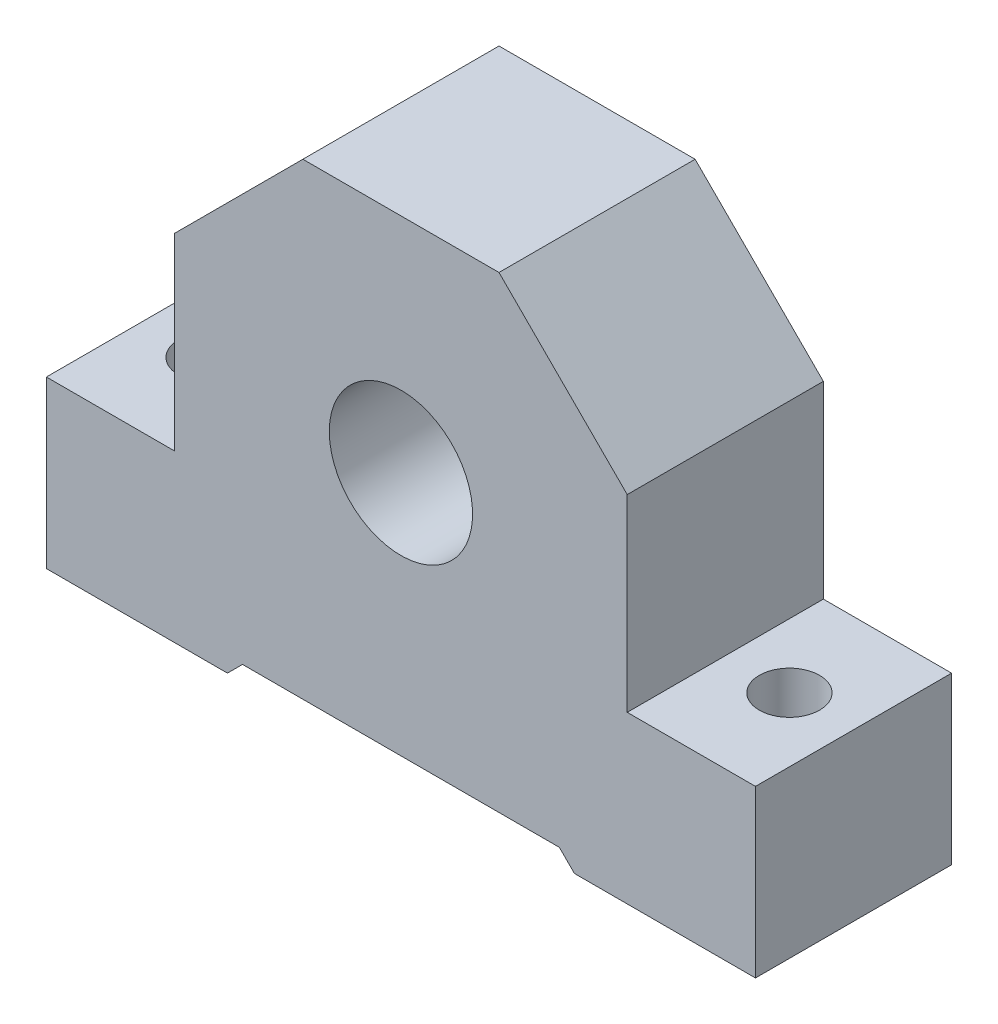
ISO-10303-21;
HEADER;
FILE_DESCRIPTION(('STEP AP214'),'2;1');
FILE_NAME('part.step','',(''),(''),'','','');
FILE_SCHEMA(('AUTOMOTIVE_DESIGN { 1 0 10303 214 1 1 1 1 }'));
ENDSEC;
DATA;
#1=APPLICATION_CONTEXT('core data for automotive mechanical design processes');
#2=APPLICATION_PROTOCOL_DEFINITION('international standard','automotive_design',2000,#1);
#3=PRODUCT_CONTEXT('',#1,'mechanical');
#4=PRODUCT('Part','Part','',(#3));
#5=PRODUCT_RELATED_PRODUCT_CATEGORY('part','',(#4));
#6=PRODUCT_DEFINITION_FORMATION('','',#4);
#7=PRODUCT_DEFINITION_CONTEXT('part definition',#1,'design');
#8=PRODUCT_DEFINITION('design','',#6,#7);
#9=PRODUCT_DEFINITION_SHAPE('','',#8);
#10=(LENGTH_UNIT() NAMED_UNIT(*) SI_UNIT(.MILLI.,.METRE.));
#11=(NAMED_UNIT(*) PLANE_ANGLE_UNIT() SI_UNIT($,.RADIAN.));
#12=(NAMED_UNIT(*) SI_UNIT($,.STERADIAN.) SOLID_ANGLE_UNIT());
#13=UNCERTAINTY_MEASURE_WITH_UNIT(LENGTH_MEASURE(1.E-05),#10,'distance_accuracy_value','');
#14=(GEOMETRIC_REPRESENTATION_CONTEXT(3) GLOBAL_UNCERTAINTY_ASSIGNED_CONTEXT((#13)) GLOBAL_UNIT_ASSIGNED_CONTEXT((#10,
#11,#12)) REPRESENTATION_CONTEXT('',''));
#15=CARTESIAN_POINT('',(0.,0.,0.));
#16=DIRECTION('',(0.,0.,1.));
#17=DIRECTION('',(1.,0.,0.));
#18=AXIS2_PLACEMENT_3D('',#15,#16,#17);
#19=CARTESIAN_POINT('',(-47.,-11.,26.));
#20=DIRECTION('',(1.,0.,0.));
#21=DIRECTION('',(0.,1.,0.));
#22=AXIS2_PLACEMENT_3D('',#19,#20,#21);
#23=PLANE('',#22);
#24=DIRECTION('',(0.,-1.,0.));
#25=VECTOR('',#24,1.);
#26=CARTESIAN_POINT('',(-47.,-11.,0.));
#27=LINE('',#26,#25);
#28=CARTESIAN_POINT('',(-47.,11.,0.));
#29=VERTEX_POINT('',#28);
#30=CARTESIAN_POINT('',(-47.,-11.,0.));
#31=VERTEX_POINT('',#30);
#32=EDGE_CURVE('E165',#29,#31,#27,.T.);
#33=ORIENTED_EDGE('',*,*,#32,.T.);
#34=DIRECTION('',(0.,0.,-1.));
#35=VECTOR('',#34,1.);
#36=CARTESIAN_POINT('',(-47.,-11.,26.));
#37=LINE('',#36,#35);
#38=CARTESIAN_POINT('',(-47.,-11.,26.));
#39=VERTEX_POINT('',#38);
#40=EDGE_CURVE('E11',#39,#31,#37,.T.);
#41=ORIENTED_EDGE('',*,*,#40,.F.);
#42=DIRECTION('',(0.,-1.,0.));
#43=VECTOR('',#42,1.);
#44=CARTESIAN_POINT('',(-47.,-11.,26.));
#45=LINE('',#44,#43);
#46=CARTESIAN_POINT('',(-47.,11.,26.));
#47=VERTEX_POINT('',#46);
#48=EDGE_CURVE('E192',#47,#39,#45,.T.);
#49=ORIENTED_EDGE('',*,*,#48,.F.);
#50=DIRECTION('',(0.,0.,-1.));
#51=VECTOR('',#50,1.);
#52=CARTESIAN_POINT('',(-47.,11.,26.));
#53=LINE('',#52,#51);
#54=EDGE_CURVE('E161',#47,#29,#53,.T.);
#55=ORIENTED_EDGE('',*,*,#54,.T.);
#56=EDGE_LOOP('',(#33,#41,#49,#55));
#57=FACE_BOUND('',#56,.T.);
#58=ADVANCED_FACE('F33',(#57),#23,.F.);
#59=CARTESIAN_POINT('',(-47.,-11.,26.));
#60=DIRECTION('',(0.,1.,0.));
#61=DIRECTION('',(0.,0.,1.));
#62=AXIS2_PLACEMENT_3D('',#59,#60,#61);
#63=PLANE('',#62);
#64=CARTESIAN_POINT('',(-38.5,-11.,13.));
#65=DIRECTION('',(0.,1.,0.));
#66=DIRECTION('',(0.,0.,1.));
#67=AXIS2_PLACEMENT_3D('',#64,#65,#66);
#68=CIRCLE('',#67,4.00000000000001);
#69=CARTESIAN_POINT('',(-38.5,-11.,17.));
#70=VERTEX_POINT('',#69);
#71=EDGE_CURVE('E407',#70,#70,#68,.T.);
#72=ORIENTED_EDGE('',*,*,#71,.T.);
#73=EDGE_LOOP('',(#72));
#74=FACE_BOUND('',#73,.T.);
#75=DIRECTION('',(1.,0.,0.));
#76=VECTOR('',#75,1.);
#77=CARTESIAN_POINT('',(-47.,-11.,0.));
#78=LINE('',#77,#76);
#79=CARTESIAN_POINT('',(-23.,-11.,0.));
#80=VERTEX_POINT('',#79);
#81=EDGE_CURVE('E168',#31,#80,#78,.T.);
#82=ORIENTED_EDGE('',*,*,#81,.T.);
#83=DIRECTION('',(0.,0.,-1.));
#84=VECTOR('',#83,1.);
#85=CARTESIAN_POINT('',(-23.,-11.,26.));
#86=LINE('',#85,#84);
#87=CARTESIAN_POINT('',(-23.,-11.,26.));
#88=VERTEX_POINT('',#87);
#89=EDGE_CURVE('E41',#88,#80,#86,.T.);
#90=ORIENTED_EDGE('',*,*,#89,.F.);
#91=DIRECTION('',(1.,0.,0.));
#92=VECTOR('',#91,1.);
#93=CARTESIAN_POINT('',(-47.,-11.,26.));
#94=LINE('',#93,#92);
#95=EDGE_CURVE('E110',#39,#88,#94,.T.);
#96=ORIENTED_EDGE('',*,*,#95,.F.);
#97=ORIENTED_EDGE('',*,*,#40,.T.);
#98=EDGE_LOOP('',(#82,#90,#96,#97));
#99=FACE_BOUND('',#98,.T.);
#100=ADVANCED_FACE('F283',(#74,#99),#63,.F.);
#101=CARTESIAN_POINT('',(-23.,-11.,26.));
#102=DIRECTION('',(-0.70710678118655,0.707106781186545,0.));
#103=DIRECTION('',(-0.707106781186545,-0.70710678118655,0.));
#104=AXIS2_PLACEMENT_3D('',#101,#102,#103);
#105=PLANE('',#104);
#106=DIRECTION('',(0.707106781186545,0.70710678118655,0.));
#107=VECTOR('',#106,1.);
#108=CARTESIAN_POINT('',(-23.,-11.,0.));
#109=LINE('',#108,#107);
#110=CARTESIAN_POINT('',(-21.,-9.00000000000001,0.));
#111=VERTEX_POINT('',#110);
#112=EDGE_CURVE('E171',#80,#111,#109,.T.);
#113=ORIENTED_EDGE('',*,*,#112,.T.);
#114=DIRECTION('',(0.,0.,-1.));
#115=VECTOR('',#114,1.);
#116=CARTESIAN_POINT('',(-21.,-9.00000000000001,26.));
#117=LINE('',#116,#115);
#118=CARTESIAN_POINT('',(-21.,-9.00000000000001,26.));
#119=VERTEX_POINT('',#118);
#120=EDGE_CURVE('E217',#119,#111,#117,.T.);
#121=ORIENTED_EDGE('',*,*,#120,.F.);
#122=DIRECTION('',(0.707106781186545,0.70710678118655,0.));
#123=VECTOR('',#122,1.);
#124=CARTESIAN_POINT('',(-23.,-11.,26.));
#125=LINE('',#124,#123);
#126=EDGE_CURVE('E225',#88,#119,#125,.T.);
#127=ORIENTED_EDGE('',*,*,#126,.F.);
#128=ORIENTED_EDGE('',*,*,#89,.T.);
#129=EDGE_LOOP('',(#113,#121,#127,#128));
#130=FACE_BOUND('',#129,.T.);
#131=ADVANCED_FACE('F223',(#130),#105,.F.);
#132=CARTESIAN_POINT('',(-21.,-9.00000000000001,26.));
#133=DIRECTION('',(0.,1.,0.));
#134=DIRECTION('',(0.,0.,1.));
#135=AXIS2_PLACEMENT_3D('',#132,#133,#134);
#136=PLANE('',#135);
#137=DIRECTION('',(1.,0.,0.));
#138=VECTOR('',#137,1.);
#139=CARTESIAN_POINT('',(-21.,-9.00000000000001,0.));
#140=LINE('',#139,#138);
#141=CARTESIAN_POINT('',(21.,-9.00000000000001,0.));
#142=VERTEX_POINT('',#141);
#143=EDGE_CURVE('E173',#111,#142,#140,.T.);
#144=ORIENTED_EDGE('',*,*,#143,.T.);
#145=DIRECTION('',(0.,0.,-1.));
#146=VECTOR('',#145,1.);
#147=CARTESIAN_POINT('',(21.,-9.00000000000001,26.));
#148=LINE('',#147,#146);
#149=CARTESIAN_POINT('',(21.,-9.00000000000001,26.));
#150=VERTEX_POINT('',#149);
#151=EDGE_CURVE('E214',#150,#142,#148,.T.);
#152=ORIENTED_EDGE('',*,*,#151,.F.);
#153=DIRECTION('',(1.,0.,0.));
#154=VECTOR('',#153,1.);
#155=CARTESIAN_POINT('',(-21.,-9.00000000000001,26.));
#156=LINE('',#155,#154);
#157=EDGE_CURVE('E243',#119,#150,#156,.T.);
#158=ORIENTED_EDGE('',*,*,#157,.F.);
#159=ORIENTED_EDGE('',*,*,#120,.T.);
#160=EDGE_LOOP('',(#144,#152,#158,#159));
#161=FACE_BOUND('',#160,.T.);
#162=ADVANCED_FACE('F234',(#161),#136,.F.);
#163=CARTESIAN_POINT('',(21.,-9.00000000000001,26.));
#164=DIRECTION('',(0.707106781186545,0.70710678118655,0.));
#165=DIRECTION('',(-0.70710678118655,0.707106781186545,0.));
#166=AXIS2_PLACEMENT_3D('',#163,#164,#165);
#167=PLANE('',#166);
#168=DIRECTION('',(0.70710678118655,-0.707106781186545,0.));
#169=VECTOR('',#168,1.);
#170=CARTESIAN_POINT('',(21.,-9.00000000000001,0.));
#171=LINE('',#170,#169);
#172=CARTESIAN_POINT('',(23.,-11.,0.));
#173=VERTEX_POINT('',#172);
#174=EDGE_CURVE('E175',#142,#173,#171,.T.);
#175=ORIENTED_EDGE('',*,*,#174,.T.);
#176=DIRECTION('',(0.,0.,-1.));
#177=VECTOR('',#176,1.);
#178=CARTESIAN_POINT('',(23.,-11.,26.));
#179=LINE('',#178,#177);
#180=CARTESIAN_POINT('',(23.,-11.,26.));
#181=VERTEX_POINT('',#180);
#182=EDGE_CURVE('E211',#181,#173,#179,.T.);
#183=ORIENTED_EDGE('',*,*,#182,.F.);
#184=DIRECTION('',(0.70710678118655,-0.707106781186545,0.));
#185=VECTOR('',#184,1.);
#186=CARTESIAN_POINT('',(21.,-9.00000000000001,26.));
#187=LINE('',#186,#185);
#188=EDGE_CURVE('E240',#150,#181,#187,.T.);
#189=ORIENTED_EDGE('',*,*,#188,.F.);
#190=ORIENTED_EDGE('',*,*,#151,.T.);
#191=EDGE_LOOP('',(#175,#183,#189,#190));
#192=FACE_BOUND('',#191,.T.);
#193=ADVANCED_FACE('F238',(#192),#167,.F.);
#194=CARTESIAN_POINT('',(23.,-11.,26.));
#195=DIRECTION('',(0.,1.,0.));
#196=DIRECTION('',(-1.,0.,0.));
#197=AXIS2_PLACEMENT_3D('',#194,#195,#196);
#198=PLANE('',#197);
#199=CARTESIAN_POINT('',(38.5,-11.,13.));
#200=DIRECTION('',(0.,1.,0.));
#201=DIRECTION('',(0.,0.,1.));
#202=AXIS2_PLACEMENT_3D('',#199,#200,#201);
#203=CIRCLE('',#202,4.00000000000001);
#204=CARTESIAN_POINT('',(38.5,-11.,17.));
#205=VERTEX_POINT('',#204);
#206=EDGE_CURVE('E403',#205,#205,#203,.T.);
#207=ORIENTED_EDGE('',*,*,#206,.T.);
#208=EDGE_LOOP('',(#207));
#209=FACE_BOUND('',#208,.T.);
#210=DIRECTION('',(1.,0.,0.));
#211=VECTOR('',#210,1.);
#212=CARTESIAN_POINT('',(23.,-11.,0.));
#213=LINE('',#212,#211);
#214=CARTESIAN_POINT('',(47.,-11.,0.));
#215=VERTEX_POINT('',#214);
#216=EDGE_CURVE('E177',#173,#215,#213,.T.);
#217=ORIENTED_EDGE('',*,*,#216,.T.);
#218=DIRECTION('',(0.,0.,-1.));
#219=VECTOR('',#218,1.);
#220=CARTESIAN_POINT('',(47.,-11.,26.));
#221=LINE('',#220,#219);
#222=CARTESIAN_POINT('',(47.,-11.,26.));
#223=VERTEX_POINT('',#222);
#224=EDGE_CURVE('E208',#223,#215,#221,.T.);
#225=ORIENTED_EDGE('',*,*,#224,.F.);
#226=DIRECTION('',(1.,0.,0.));
#227=VECTOR('',#226,1.);
#228=CARTESIAN_POINT('',(23.,-11.,26.));
#229=LINE('',#228,#227);
#230=EDGE_CURVE('E242',#181,#223,#229,.T.);
#231=ORIENTED_EDGE('',*,*,#230,.F.);
#232=ORIENTED_EDGE('',*,*,#182,.T.);
#233=EDGE_LOOP('',(#217,#225,#231,#232));
#234=FACE_BOUND('',#233,.T.);
#235=ADVANCED_FACE('F298',(#209,#234),#198,.F.);
#236=CARTESIAN_POINT('',(47.,-11.,26.));
#237=DIRECTION('',(-1.,0.,0.));
#238=DIRECTION('',(0.,-1.,0.));
#239=AXIS2_PLACEMENT_3D('',#236,#237,#238);
#240=PLANE('',#239);
#241=DIRECTION('',(0.,1.,0.));
#242=VECTOR('',#241,1.);
#243=CARTESIAN_POINT('',(47.,-11.,0.));
#244=LINE('',#243,#242);
#245=CARTESIAN_POINT('',(47.,11.,0.));
#246=VERTEX_POINT('',#245);
#247=EDGE_CURVE('E179',#215,#246,#244,.T.);
#248=ORIENTED_EDGE('',*,*,#247,.T.);
#249=DIRECTION('',(0.,0.,-1.));
#250=VECTOR('',#249,1.);
#251=CARTESIAN_POINT('',(47.,11.,26.));
#252=LINE('',#251,#250);
#253=CARTESIAN_POINT('',(47.,11.,26.));
#254=VERTEX_POINT('',#253);
#255=EDGE_CURVE('E205',#254,#246,#252,.T.);
#256=ORIENTED_EDGE('',*,*,#255,.F.);
#257=DIRECTION('',(0.,1.,0.));
#258=VECTOR('',#257,1.);
#259=CARTESIAN_POINT('',(47.,-11.,26.));
#260=LINE('',#259,#258);
#261=EDGE_CURVE('E245',#223,#254,#260,.T.);
#262=ORIENTED_EDGE('',*,*,#261,.F.);
#263=ORIENTED_EDGE('',*,*,#224,.T.);
#264=EDGE_LOOP('',(#248,#256,#262,#263));
#265=FACE_BOUND('',#264,.T.);
#266=ADVANCED_FACE('F301',(#265),#240,.F.);
#267=CARTESIAN_POINT('',(30.,11.,26.));
#268=DIRECTION('',(0.,-1.,0.));
#269=DIRECTION('',(0.,0.,-1.));
#270=AXIS2_PLACEMENT_3D('',#267,#268,#269);
#271=PLANE('',#270);
#272=CARTESIAN_POINT('',(38.5,11.,13.));
#273=DIRECTION('',(0.,1.,0.));
#274=DIRECTION('',(0.,0.,1.));
#275=AXIS2_PLACEMENT_3D('',#272,#273,#274);
#276=CIRCLE('',#275,4.00000000000001);
#277=CARTESIAN_POINT('',(38.5,11.,17.));
#278=VERTEX_POINT('',#277);
#279=EDGE_CURVE('E406',#278,#278,#276,.T.);
#280=ORIENTED_EDGE('',*,*,#279,.F.);
#281=EDGE_LOOP('',(#280));
#282=FACE_BOUND('',#281,.T.);
#283=DIRECTION('',(-1.,0.,0.));
#284=VECTOR('',#283,1.);
#285=CARTESIAN_POINT('',(30.,11.,0.));
#286=LINE('',#285,#284);
#287=CARTESIAN_POINT('',(30.,11.,0.));
#288=VERTEX_POINT('',#287);
#289=EDGE_CURVE('E181',#246,#288,#286,.T.);
#290=ORIENTED_EDGE('',*,*,#289,.T.);
#291=DIRECTION('',(0.,0.,-1.));
#292=VECTOR('',#291,1.);
#293=CARTESIAN_POINT('',(30.,11.,26.));
#294=LINE('',#293,#292);
#295=CARTESIAN_POINT('',(30.,11.,26.));
#296=VERTEX_POINT('',#295);
#297=EDGE_CURVE('E202',#296,#288,#294,.T.);
#298=ORIENTED_EDGE('',*,*,#297,.F.);
#299=DIRECTION('',(-1.,0.,0.));
#300=VECTOR('',#299,1.);
#301=CARTESIAN_POINT('',(30.,11.,26.));
#302=LINE('',#301,#300);
#303=EDGE_CURVE('E251',#254,#296,#302,.T.);
#304=ORIENTED_EDGE('',*,*,#303,.F.);
#305=ORIENTED_EDGE('',*,*,#255,.T.);
#306=EDGE_LOOP('',(#290,#298,#304,#305));
#307=FACE_BOUND('',#306,.T.);
#308=ADVANCED_FACE('F305',(#282,#307),#271,.F.);
#309=CARTESIAN_POINT('',(29.9999999999999,36.,26.));
#310=DIRECTION('',(-1.,0.,0.));
#311=DIRECTION('',(0.,-1.,0.));
#312=AXIS2_PLACEMENT_3D('',#309,#310,#311);
#313=PLANE('',#312);
#314=DIRECTION('',(0.,1.,0.));
#315=VECTOR('',#314,1.);
#316=CARTESIAN_POINT('',(29.9999999999999,36.,0.));
#317=LINE('',#316,#315);
#318=CARTESIAN_POINT('',(29.9999999999999,36.,0.));
#319=VERTEX_POINT('',#318);
#320=EDGE_CURVE('E183',#288,#319,#317,.T.);
#321=ORIENTED_EDGE('',*,*,#320,.T.);
#322=DIRECTION('',(0.,0.,-1.));
#323=VECTOR('',#322,1.);
#324=CARTESIAN_POINT('',(29.9999999999999,36.,26.));
#325=LINE('',#324,#323);
#326=CARTESIAN_POINT('',(29.9999999999999,36.,26.));
#327=VERTEX_POINT('',#326);
#328=EDGE_CURVE('E199',#327,#319,#325,.T.);
#329=ORIENTED_EDGE('',*,*,#328,.F.);
#330=DIRECTION('',(0.,1.,0.));
#331=VECTOR('',#330,1.);
#332=CARTESIAN_POINT('',(29.9999999999999,36.,26.));
#333=LINE('',#332,#331);
#334=EDGE_CURVE('E253',#296,#327,#333,.T.);
#335=ORIENTED_EDGE('',*,*,#334,.F.);
#336=ORIENTED_EDGE('',*,*,#297,.T.);
#337=EDGE_LOOP('',(#321,#329,#335,#336));
#338=FACE_BOUND('',#337,.T.);
#339=ADVANCED_FACE('F309',(#338),#313,.F.);
#340=CARTESIAN_POINT('',(13.,53.,26.));
#341=DIRECTION('',(-0.707106781186549,-0.707106781186546,0.));
#342=DIRECTION('',(0.707106781186546,-0.707106781186549,0.));
#343=AXIS2_PLACEMENT_3D('',#340,#341,#342);
#344=PLANE('',#343);
#345=DIRECTION('',(-0.707106781186546,0.707106781186549,0.));
#346=VECTOR('',#345,1.);
#347=CARTESIAN_POINT('',(13.,53.,0.));
#348=LINE('',#347,#346);
#349=CARTESIAN_POINT('',(13.,53.,0.));
#350=VERTEX_POINT('',#349);
#351=EDGE_CURVE('E185',#319,#350,#348,.T.);
#352=ORIENTED_EDGE('',*,*,#351,.T.);
#353=DIRECTION('',(0.,0.,-1.));
#354=VECTOR('',#353,1.);
#355=CARTESIAN_POINT('',(13.,53.,26.));
#356=LINE('',#355,#354);
#357=CARTESIAN_POINT('',(13.,53.,26.));
#358=VERTEX_POINT('',#357);
#359=EDGE_CURVE('E196',#358,#350,#356,.T.);
#360=ORIENTED_EDGE('',*,*,#359,.F.);
#361=DIRECTION('',(-0.707106781186546,0.707106781186549,0.));
#362=VECTOR('',#361,1.);
#363=CARTESIAN_POINT('',(13.,53.,26.));
#364=LINE('',#363,#362);
#365=EDGE_CURVE('E255',#327,#358,#364,.T.);
#366=ORIENTED_EDGE('',*,*,#365,.F.);
#367=ORIENTED_EDGE('',*,*,#328,.T.);
#368=EDGE_LOOP('',(#352,#360,#366,#367));
#369=FACE_BOUND('',#368,.T.);
#370=ADVANCED_FACE('F261',(#369),#344,.F.);
#371=CARTESIAN_POINT('',(-13.,53.,26.));
#372=DIRECTION('',(0.,-1.,0.));
#373=DIRECTION('',(0.,0.,-1.));
#374=AXIS2_PLACEMENT_3D('',#371,#372,#373);
#375=PLANE('',#374);
#376=DIRECTION('',(-1.,0.,0.));
#377=VECTOR('',#376,1.);
#378=CARTESIAN_POINT('',(-13.,53.,0.));
#379=LINE('',#378,#377);
#380=CARTESIAN_POINT('',(-13.,53.,0.));
#381=VERTEX_POINT('',#380);
#382=EDGE_CURVE('E187',#350,#381,#379,.T.);
#383=ORIENTED_EDGE('',*,*,#382,.T.);
#384=DIRECTION('',(0.,0.,-1.));
#385=VECTOR('',#384,1.);
#386=CARTESIAN_POINT('',(-13.,53.,26.));
#387=LINE('',#386,#385);
#388=CARTESIAN_POINT('',(-13.,53.,26.));
#389=VERTEX_POINT('',#388);
#390=EDGE_CURVE('E156',#389,#381,#387,.T.);
#391=ORIENTED_EDGE('',*,*,#390,.F.);
#392=DIRECTION('',(-1.,0.,0.));
#393=VECTOR('',#392,1.);
#394=CARTESIAN_POINT('',(-13.,53.,26.));
#395=LINE('',#394,#393);
#396=EDGE_CURVE('E147',#358,#389,#395,.T.);
#397=ORIENTED_EDGE('',*,*,#396,.F.);
#398=ORIENTED_EDGE('',*,*,#359,.T.);
#399=EDGE_LOOP('',(#383,#391,#397,#398));
#400=FACE_BOUND('',#399,.T.);
#401=ADVANCED_FACE('F265',(#400),#375,.F.);
#402=CARTESIAN_POINT('',(-30.,35.9999999999999,26.));
#403=DIRECTION('',(0.707106781186549,-0.707106781186546,0.));
#404=DIRECTION('',(0.707106781186546,0.707106781186549,0.));
#405=AXIS2_PLACEMENT_3D('',#402,#403,#404);
#406=PLANE('',#405);
#407=DIRECTION('',(-0.707106781186546,-0.707106781186549,0.));
#408=VECTOR('',#407,1.);
#409=CARTESIAN_POINT('',(-30.,35.9999999999999,0.));
#410=LINE('',#409,#408);
#411=CARTESIAN_POINT('',(-30.,35.9999999999999,0.));
#412=VERTEX_POINT('',#411);
#413=EDGE_CURVE('E155',#381,#412,#410,.T.);
#414=ORIENTED_EDGE('',*,*,#413,.T.);
#415=DIRECTION('',(0.,0.,-1.));
#416=VECTOR('',#415,1.);
#417=CARTESIAN_POINT('',(-30.,35.9999999999999,26.));
#418=LINE('',#417,#416);
#419=CARTESIAN_POINT('',(-30.,35.9999999999999,26.));
#420=VERTEX_POINT('',#419);
#421=EDGE_CURVE('E152',#420,#412,#418,.T.);
#422=ORIENTED_EDGE('',*,*,#421,.F.);
#423=DIRECTION('',(-0.707106781186546,-0.707106781186549,0.));
#424=VECTOR('',#423,1.);
#425=CARTESIAN_POINT('',(-30.,35.9999999999999,26.));
#426=LINE('',#425,#424);
#427=EDGE_CURVE('E141',#389,#420,#426,.T.);
#428=ORIENTED_EDGE('',*,*,#427,.F.);
#429=ORIENTED_EDGE('',*,*,#390,.T.);
#430=EDGE_LOOP('',(#414,#422,#428,#429));
#431=FACE_BOUND('',#430,.T.);
#432=ADVANCED_FACE('F153',(#431),#406,.F.);
#433=CARTESIAN_POINT('',(-30.,11.,26.));
#434=DIRECTION('',(1.,0.,0.));
#435=DIRECTION('',(0.,1.,0.));
#436=AXIS2_PLACEMENT_3D('',#433,#434,#435);
#437=PLANE('',#436);
#438=DIRECTION('',(0.,-1.,0.));
#439=VECTOR('',#438,1.);
#440=CARTESIAN_POINT('',(-30.,11.,0.));
#441=LINE('',#440,#439);
#442=CARTESIAN_POINT('',(-30.,11.,0.));
#443=VERTEX_POINT('',#442);
#444=EDGE_CURVE('E96',#412,#443,#441,.T.);
#445=ORIENTED_EDGE('',*,*,#444,.T.);
#446=DIRECTION('',(0.,0.,-1.));
#447=VECTOR('',#446,1.);
#448=CARTESIAN_POINT('',(-30.,11.,26.));
#449=LINE('',#448,#447);
#450=CARTESIAN_POINT('',(-30.,11.,26.));
#451=VERTEX_POINT('',#450);
#452=EDGE_CURVE('E157',#451,#443,#449,.T.);
#453=ORIENTED_EDGE('',*,*,#452,.F.);
#454=DIRECTION('',(0.,-1.,0.));
#455=VECTOR('',#454,1.);
#456=CARTESIAN_POINT('',(-30.,11.,26.));
#457=LINE('',#456,#455);
#458=EDGE_CURVE('E145',#420,#451,#457,.T.);
#459=ORIENTED_EDGE('',*,*,#458,.F.);
#460=ORIENTED_EDGE('',*,*,#421,.T.);
#461=EDGE_LOOP('',(#445,#453,#459,#460));
#462=FACE_BOUND('',#461,.T.);
#463=ADVANCED_FACE('F159',(#462),#437,.F.);
#464=CARTESIAN_POINT('',(-47.,11.,26.));
#465=DIRECTION('',(0.,-1.,0.));
#466=DIRECTION('',(0.,0.,-1.));
#467=AXIS2_PLACEMENT_3D('',#464,#465,#466);
#468=PLANE('',#467);
#469=CARTESIAN_POINT('',(-38.5,11.,13.));
#470=DIRECTION('',(0.,1.,0.));
#471=DIRECTION('',(0.,0.,1.));
#472=AXIS2_PLACEMENT_3D('',#469,#470,#471);
#473=CIRCLE('',#472,4.00000000000001);
#474=CARTESIAN_POINT('',(-38.5,11.,17.));
#475=VERTEX_POINT('',#474);
#476=EDGE_CURVE('E411',#475,#475,#473,.T.);
#477=ORIENTED_EDGE('',*,*,#476,.F.);
#478=EDGE_LOOP('',(#477));
#479=FACE_BOUND('',#478,.T.);
#480=DIRECTION('',(-1.,0.,0.));
#481=VECTOR('',#480,1.);
#482=CARTESIAN_POINT('',(-47.,11.,0.));
#483=LINE('',#482,#481);
#484=EDGE_CURVE('E102',#443,#29,#483,.T.);
#485=ORIENTED_EDGE('',*,*,#484,.T.);
#486=ORIENTED_EDGE('',*,*,#54,.F.);
#487=DIRECTION('',(-1.,0.,0.));
#488=VECTOR('',#487,1.);
#489=CARTESIAN_POINT('',(-47.,11.,26.));
#490=LINE('',#489,#488);
#491=EDGE_CURVE('E49',#451,#47,#490,.T.);
#492=ORIENTED_EDGE('',*,*,#491,.F.);
#493=ORIENTED_EDGE('',*,*,#452,.T.);
#494=EDGE_LOOP('',(#485,#486,#492,#493));
#495=FACE_BOUND('',#494,.T.);
#496=ADVANCED_FACE('F269',(#479,#495),#468,.F.);
#497=CARTESIAN_POINT('',(0.,0.,26.));
#498=DIRECTION('',(0.,0.,-1.));
#499=DIRECTION('',(-1.,0.,0.));
#500=AXIS2_PLACEMENT_3D('',#497,#498,#499);
#501=PLANE('',#500);
#502=CARTESIAN_POINT('',(0.,23.5,26.));
#503=DIRECTION('',(0.,0.,-1.));
#504=DIRECTION('',(-1.,0.,0.));
#505=AXIS2_PLACEMENT_3D('',#502,#503,#504);
#506=CIRCLE('',#505,9.5);
#507=CARTESIAN_POINT('',(-9.5,23.5,26.));
#508=VERTEX_POINT('',#507);
#509=EDGE_CURVE('E169',#508,#508,#506,.T.);
#510=ORIENTED_EDGE('',*,*,#509,.T.);
#511=EDGE_LOOP('',(#510));
#512=FACE_BOUND('',#511,.T.);
#513=ORIENTED_EDGE('',*,*,#48,.T.);
#514=ORIENTED_EDGE('',*,*,#95,.T.);
#515=ORIENTED_EDGE('',*,*,#126,.T.);
#516=ORIENTED_EDGE('',*,*,#157,.T.);
#517=ORIENTED_EDGE('',*,*,#188,.T.);
#518=ORIENTED_EDGE('',*,*,#230,.T.);
#519=ORIENTED_EDGE('',*,*,#261,.T.);
#520=ORIENTED_EDGE('',*,*,#303,.T.);
#521=ORIENTED_EDGE('',*,*,#334,.T.);
#522=ORIENTED_EDGE('',*,*,#365,.T.);
#523=ORIENTED_EDGE('',*,*,#396,.T.);
#524=ORIENTED_EDGE('',*,*,#427,.T.);
#525=ORIENTED_EDGE('',*,*,#458,.T.);
#526=ORIENTED_EDGE('',*,*,#491,.T.);
#527=EDGE_LOOP('',(#513,#514,#515,#516,#517,#518,#519,#520,#521,#522,#523,#524,#525,#526));
#528=FACE_BOUND('',#527,.T.);
#529=ADVANCED_FACE('F143',(#512,#528),#501,.F.);
#530=CARTESIAN_POINT('',(0.,0.,0.));
#531=DIRECTION('',(0.,0.,-1.));
#532=DIRECTION('',(-1.,0.,0.));
#533=AXIS2_PLACEMENT_3D('',#530,#531,#532);
#534=PLANE('',#533);
#535=CARTESIAN_POINT('',(0.,23.5,0.));
#536=DIRECTION('',(0.,0.,-1.));
#537=DIRECTION('',(-1.,0.,0.));
#538=AXIS2_PLACEMENT_3D('',#535,#536,#537);
#539=CIRCLE('',#538,9.5);
#540=CARTESIAN_POINT('',(-9.5,23.5,0.));
#541=VERTEX_POINT('',#540);
#542=EDGE_CURVE('E409',#541,#541,#539,.T.);
#543=ORIENTED_EDGE('',*,*,#542,.F.);
#544=EDGE_LOOP('',(#543));
#545=FACE_BOUND('',#544,.T.);
#546=ORIENTED_EDGE('',*,*,#32,.F.);
#547=ORIENTED_EDGE('',*,*,#484,.F.);
#548=ORIENTED_EDGE('',*,*,#444,.F.);
#549=ORIENTED_EDGE('',*,*,#413,.F.);
#550=ORIENTED_EDGE('',*,*,#382,.F.);
#551=ORIENTED_EDGE('',*,*,#351,.F.);
#552=ORIENTED_EDGE('',*,*,#320,.F.);
#553=ORIENTED_EDGE('',*,*,#289,.F.);
#554=ORIENTED_EDGE('',*,*,#247,.F.);
#555=ORIENTED_EDGE('',*,*,#216,.F.);
#556=ORIENTED_EDGE('',*,*,#174,.F.);
#557=ORIENTED_EDGE('',*,*,#143,.F.);
#558=ORIENTED_EDGE('',*,*,#112,.F.);
#559=ORIENTED_EDGE('',*,*,#81,.F.);
#560=EDGE_LOOP('',(#546,#547,#548,#549,#550,#551,#552,#553,#554,#555,#556,#557,#558,#559));
#561=FACE_BOUND('',#560,.T.);
#562=ADVANCED_FACE('F229',(#545,#561),#534,.T.);
#563=CARTESIAN_POINT('',(0.,23.5,26.));
#564=DIRECTION('',(0.,0.,-1.));
#565=DIRECTION('',(-1.,0.,0.));
#566=AXIS2_PLACEMENT_3D('',#563,#564,#565);
#567=CYLINDRICAL_SURFACE('',#566,9.5);
#568=ORIENTED_EDGE('',*,*,#509,.F.);
#569=EDGE_LOOP('',(#568));
#570=FACE_BOUND('',#569,.T.);
#571=ORIENTED_EDGE('',*,*,#542,.T.);
#572=EDGE_LOOP('',(#571));
#573=FACE_BOUND('',#572,.T.);
#574=ADVANCED_FACE('F343',(#570,#573),#567,.F.);
#575=CARTESIAN_POINT('',(-38.5,-11.,13.));
#576=DIRECTION('',(0.,1.,0.));
#577=DIRECTION('',(0.,0.,1.));
#578=AXIS2_PLACEMENT_3D('',#575,#576,#577);
#579=CYLINDRICAL_SURFACE('',#578,4.00000000000001);
#580=ORIENTED_EDGE('',*,*,#71,.F.);
#581=EDGE_LOOP('',(#580));
#582=FACE_BOUND('',#581,.T.);
#583=ORIENTED_EDGE('',*,*,#476,.T.);
#584=EDGE_LOOP('',(#583));
#585=FACE_BOUND('',#584,.T.);
#586=ADVANCED_FACE('F351',(#582,#585),#579,.F.);
#587=CARTESIAN_POINT('',(38.5,-11.,13.));
#588=DIRECTION('',(0.,1.,0.));
#589=DIRECTION('',(0.,0.,1.));
#590=AXIS2_PLACEMENT_3D('',#587,#588,#589);
#591=CYLINDRICAL_SURFACE('',#590,4.00000000000001);
#592=ORIENTED_EDGE('',*,*,#206,.F.);
#593=EDGE_LOOP('',(#592));
#594=FACE_BOUND('',#593,.T.);
#595=ORIENTED_EDGE('',*,*,#279,.T.);
#596=EDGE_LOOP('',(#595));
#597=FACE_BOUND('',#596,.T.);
#598=ADVANCED_FACE('F386',(#594,#597),#591,.F.);
#599=CLOSED_SHELL('',(#58,#100,#131,#162,#193,#235,#266,#308,#339,#370,#401,#432,#463,#496,#529,
#562,#574,#586,#598));
#600=MANIFOLD_SOLID_BREP('B2',#599);
#601=ADVANCED_BREP_SHAPE_REPRESENTATION('',(#18,#600),#14);
#602=SHAPE_DEFINITION_REPRESENTATION(#9,#601);
ENDSEC;
END-ISO-10303-21;
